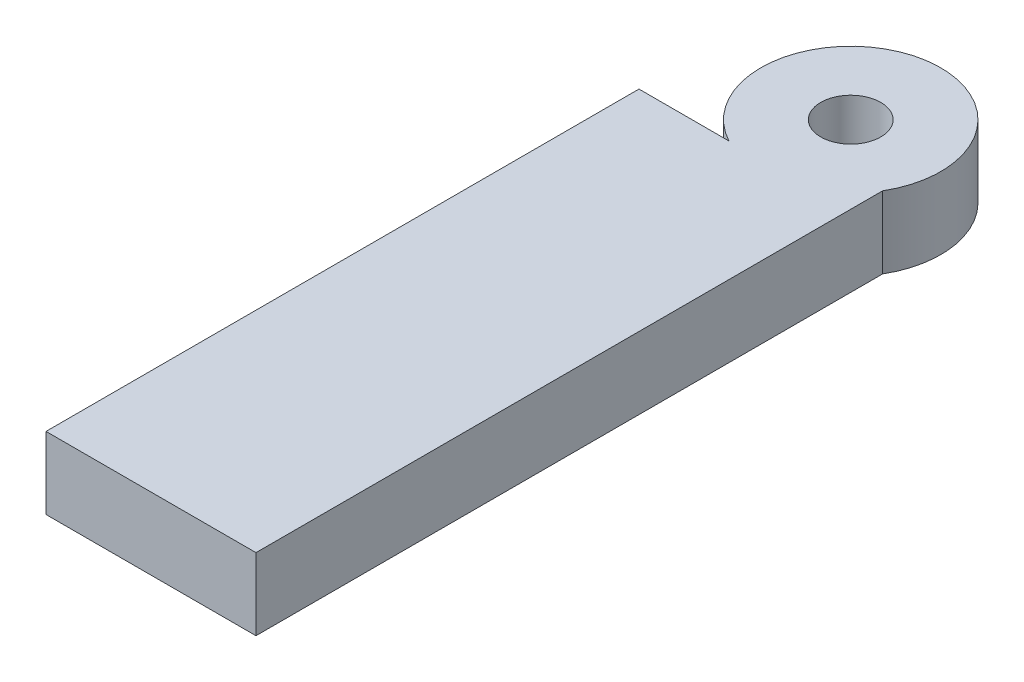
ISO-10303-21;
HEADER;
FILE_DESCRIPTION(('STEP AP214'),'2;1');
FILE_NAME('part.step','',(''),(''),'','','');
FILE_SCHEMA(('AUTOMOTIVE_DESIGN { 1 0 10303 214 1 1 1 1 }'));
ENDSEC;
DATA;
#1=APPLICATION_CONTEXT('core data for automotive mechanical design processes');
#2=APPLICATION_PROTOCOL_DEFINITION('international standard','automotive_design',2000,#1);
#3=PRODUCT_CONTEXT('',#1,'mechanical');
#4=PRODUCT('Part','Part','',(#3));
#5=PRODUCT_RELATED_PRODUCT_CATEGORY('part','',(#4));
#6=PRODUCT_DEFINITION_FORMATION('','',#4);
#7=PRODUCT_DEFINITION_CONTEXT('part definition',#1,'design');
#8=PRODUCT_DEFINITION('design','',#6,#7);
#9=PRODUCT_DEFINITION_SHAPE('','',#8);
#10=(LENGTH_UNIT() NAMED_UNIT(*) SI_UNIT(.MILLI.,.METRE.));
#11=(NAMED_UNIT(*) PLANE_ANGLE_UNIT() SI_UNIT($,.RADIAN.));
#12=(NAMED_UNIT(*) SI_UNIT($,.STERADIAN.) SOLID_ANGLE_UNIT());
#13=UNCERTAINTY_MEASURE_WITH_UNIT(LENGTH_MEASURE(1.E-05),#10,'distance_accuracy_value','');
#14=(GEOMETRIC_REPRESENTATION_CONTEXT(3) GLOBAL_UNCERTAINTY_ASSIGNED_CONTEXT((#13)) GLOBAL_UNIT_ASSIGNED_CONTEXT((#10,
#11,#12)) REPRESENTATION_CONTEXT('',''));
#15=CARTESIAN_POINT('',(0.,0.,0.));
#16=DIRECTION('',(0.,0.,1.));
#17=DIRECTION('',(1.,0.,0.));
#18=AXIS2_PLACEMENT_3D('',#15,#16,#17);
#19=CARTESIAN_POINT('',(8.20987193946542,7.62,0.));
#20=DIRECTION('',(-1.,0.,0.));
#21=DIRECTION('',(0.,0.,1.));
#22=AXIS2_PLACEMENT_3D('',#19,#20,#21);
#23=PLANE('',#22);
#24=DIRECTION('',(0.,0.,-1.));
#25=VECTOR('',#24,1.);
#26=CARTESIAN_POINT('',(8.20987193946542,0.,0.));
#27=LINE('',#26,#25);
#28=CARTESIAN_POINT('',(8.20987193946543,0.,71.1651280605346));
#29=VERTEX_POINT('',#28);
#30=CARTESIAN_POINT('',(8.20987193946542,0.,4.82945418630079));
#31=VERTEX_POINT('',#30);
#32=EDGE_CURVE('E125',#29,#31,#27,.T.);
#33=ORIENTED_EDGE('',*,*,#32,.T.);
#34=DIRECTION('',(0.,-1.,0.));
#35=VECTOR('',#34,1.);
#36=CARTESIAN_POINT('',(8.20987193946542,7.62,4.82945418630079));
#37=LINE('',#36,#35);
#38=CARTESIAN_POINT('',(8.20987193946542,7.62,4.82945418630079));
#39=VERTEX_POINT('',#38);
#40=EDGE_CURVE('E11',#39,#31,#37,.T.);
#41=ORIENTED_EDGE('',*,*,#40,.F.);
#42=DIRECTION('',(0.,0.,-1.));
#43=VECTOR('',#42,1.);
#44=CARTESIAN_POINT('',(8.20987193946542,7.62,0.));
#45=LINE('',#44,#43);
#46=CARTESIAN_POINT('',(8.20987193946543,7.62,71.1651280605346));
#47=VERTEX_POINT('',#46);
#48=EDGE_CURVE('E127',#47,#39,#45,.T.);
#49=ORIENTED_EDGE('',*,*,#48,.F.);
#50=DIRECTION('',(0.,-1.,0.));
#51=VECTOR('',#50,1.);
#52=CARTESIAN_POINT('',(8.20987193946543,7.62,71.1651280605346));
#53=LINE('',#52,#51);
#54=EDGE_CURVE('E135',#47,#29,#53,.T.);
#55=ORIENTED_EDGE('',*,*,#54,.T.);
#56=EDGE_LOOP('',(#33,#41,#49,#55));
#57=FACE_BOUND('',#56,.T.);
#58=ADVANCED_FACE('F41',(#57),#23,.F.);
#59=CARTESIAN_POINT('',(0.,7.62,0.));
#60=DIRECTION('',(0.,-1.,0.));
#61=DIRECTION('',(0.,0.,-1.));
#62=AXIS2_PLACEMENT_3D('',#59,#60,#61);
#63=CYLINDRICAL_SURFACE('',#62,9.525);
#64=CARTESIAN_POINT('',(0.,0.,0.));
#65=DIRECTION('',(0.,1.,0.));
#66=DIRECTION('',(0.,0.,1.));
#67=AXIS2_PLACEMENT_3D('',#64,#65,#66);
#68=CIRCLE('',#67,9.525);
#69=CARTESIAN_POINT('',(-4.49012806053458,0.,8.40026041263007));
#70=VERTEX_POINT('',#69);
#71=EDGE_CURVE('E71',#31,#70,#68,.T.);
#72=ORIENTED_EDGE('',*,*,#71,.T.);
#73=DIRECTION('',(0.,-1.,0.));
#74=VECTOR('',#73,1.);
#75=CARTESIAN_POINT('',(-4.49012806053458,7.62,8.40026041263007));
#76=LINE('',#75,#74);
#77=CARTESIAN_POINT('',(-4.49012806053458,7.62,8.40026041263007));
#78=VERTEX_POINT('',#77);
#79=EDGE_CURVE('E49',#78,#70,#76,.T.);
#80=ORIENTED_EDGE('',*,*,#79,.F.);
#81=CARTESIAN_POINT('',(0.,7.62,0.));
#82=DIRECTION('',(0.,1.,0.));
#83=DIRECTION('',(0.,0.,1.));
#84=AXIS2_PLACEMENT_3D('',#81,#82,#83);
#85=CIRCLE('',#84,9.525);
#86=EDGE_CURVE('E80',#39,#78,#85,.T.);
#87=ORIENTED_EDGE('',*,*,#86,.F.);
#88=ORIENTED_EDGE('',*,*,#40,.T.);
#89=EDGE_LOOP('',(#72,#80,#87,#88));
#90=FACE_BOUND('',#89,.T.);
#91=ADVANCED_FACE('F145',(#90),#63,.T.);
#92=CARTESIAN_POINT('',(0.,7.62,71.1651280605346));
#93=DIRECTION('',(0.,0.,-1.));
#94=DIRECTION('',(-1.,0.,0.));
#95=AXIS2_PLACEMENT_3D('',#92,#93,#94);
#96=PLANE('',#95);
#97=DIRECTION('',(1.,0.,0.));
#98=VECTOR('',#97,1.);
#99=CARTESIAN_POINT('',(0.,0.,71.1651280605346));
#100=LINE('',#99,#98);
#101=CARTESIAN_POINT('',(-14.0151280605346,0.,71.1651280605346));
#102=VERTEX_POINT('',#101);
#103=EDGE_CURVE('E77',#102,#29,#100,.T.);
#104=ORIENTED_EDGE('',*,*,#103,.T.);
#105=ORIENTED_EDGE('',*,*,#54,.F.);
#106=DIRECTION('',(1.,0.,0.));
#107=VECTOR('',#106,1.);
#108=CARTESIAN_POINT('',(0.,7.62,71.1651280605346));
#109=LINE('',#108,#107);
#110=CARTESIAN_POINT('',(-14.0151280605346,7.62,71.1651280605346));
#111=VERTEX_POINT('',#110);
#112=EDGE_CURVE('E57',#111,#47,#109,.T.);
#113=ORIENTED_EDGE('',*,*,#112,.F.);
#114=DIRECTION('',(0.,1.,0.));
#115=VECTOR('',#114,1.);
#116=CARTESIAN_POINT('',(-14.0151280605346,0.,71.1651280605346));
#117=LINE('',#116,#115);
#118=EDGE_CURVE('E102',#102,#111,#117,.T.);
#119=ORIENTED_EDGE('',*,*,#118,.F.);
#120=EDGE_LOOP('',(#104,#105,#113,#119));
#121=FACE_BOUND('',#120,.T.);
#122=ADVANCED_FACE('F147',(#121),#96,.F.);
#123=CARTESIAN_POINT('',(0.,7.62,0.));
#124=DIRECTION('',(0.,-1.,0.));
#125=DIRECTION('',(0.,0.,-1.));
#126=AXIS2_PLACEMENT_3D('',#123,#124,#125);
#127=CYLINDRICAL_SURFACE('',#126,3.175);
#128=CARTESIAN_POINT('',(0.,7.62,0.));
#129=DIRECTION('',(0.,1.,0.));
#130=DIRECTION('',(0.,0.,1.));
#131=AXIS2_PLACEMENT_3D('',#128,#129,#130);
#132=CIRCLE('',#131,3.175);
#133=CARTESIAN_POINT('',(0.,7.62,3.175));
#134=VERTEX_POINT('',#133);
#135=EDGE_CURVE('E132',#134,#134,#132,.T.);
#136=ORIENTED_EDGE('',*,*,#135,.T.);
#137=EDGE_LOOP('',(#136));
#138=FACE_BOUND('',#137,.T.);
#139=CARTESIAN_POINT('',(0.,0.,0.));
#140=DIRECTION('',(0.,1.,0.));
#141=DIRECTION('',(0.,0.,1.));
#142=AXIS2_PLACEMENT_3D('',#139,#140,#141);
#143=CIRCLE('',#142,3.175);
#144=CARTESIAN_POINT('',(0.,0.,3.175));
#145=VERTEX_POINT('',#144);
#146=EDGE_CURVE('E129',#145,#145,#143,.T.);
#147=ORIENTED_EDGE('',*,*,#146,.F.);
#148=EDGE_LOOP('',(#147));
#149=FACE_BOUND('',#148,.T.);
#150=ADVANCED_FACE('F152',(#138,#149),#127,.F.);
#151=CARTESIAN_POINT('',(0.,7.62,0.));
#152=DIRECTION('',(0.,1.,0.));
#153=DIRECTION('',(0.,0.,1.));
#154=AXIS2_PLACEMENT_3D('',#151,#152,#153);
#155=PLANE('',#154);
#156=ORIENTED_EDGE('',*,*,#48,.T.);
#157=ORIENTED_EDGE('',*,*,#86,.T.);
#158=DIRECTION('',(1.,0.,0.));
#159=VECTOR('',#158,1.);
#160=CARTESIAN_POINT('',(-14.0151280605346,7.62,8.40026041263007));
#161=LINE('',#160,#159);
#162=CARTESIAN_POINT('',(-14.0151280605346,7.62,8.40026041263007));
#163=VERTEX_POINT('',#162);
#164=EDGE_CURVE('E116',#163,#78,#161,.T.);
#165=ORIENTED_EDGE('',*,*,#164,.F.);
#166=DIRECTION('',(0.,0.,-1.));
#167=VECTOR('',#166,1.);
#168=CARTESIAN_POINT('',(-14.0151280605346,7.62,71.1651280605346));
#169=LINE('',#168,#167);
#170=EDGE_CURVE('E108',#111,#163,#169,.T.);
#171=ORIENTED_EDGE('',*,*,#170,.F.);
#172=ORIENTED_EDGE('',*,*,#112,.T.);
#173=EDGE_LOOP('',(#156,#157,#165,#171,#172));
#174=FACE_BOUND('',#173,.T.);
#175=ORIENTED_EDGE('',*,*,#135,.F.);
#176=EDGE_LOOP('',(#175));
#177=FACE_BOUND('',#176,.T.);
#178=ADVANCED_FACE('F157',(#174,#177),#155,.T.);
#179=CARTESIAN_POINT('',(0.,0.,0.));
#180=DIRECTION('',(0.,1.,0.));
#181=DIRECTION('',(0.,0.,1.));
#182=AXIS2_PLACEMENT_3D('',#179,#180,#181);
#183=PLANE('',#182);
#184=ORIENTED_EDGE('',*,*,#32,.F.);
#185=ORIENTED_EDGE('',*,*,#103,.F.);
#186=DIRECTION('',(0.,0.,1.));
#187=VECTOR('',#186,1.);
#188=CARTESIAN_POINT('',(-14.0151280605346,0.,8.40026041263007));
#189=LINE('',#188,#187);
#190=CARTESIAN_POINT('',(-14.0151280605346,0.,8.40026041263007));
#191=VERTEX_POINT('',#190);
#192=EDGE_CURVE('E92',#191,#102,#189,.T.);
#193=ORIENTED_EDGE('',*,*,#192,.F.);
#194=DIRECTION('',(1.,0.,0.));
#195=VECTOR('',#194,1.);
#196=CARTESIAN_POINT('',(-14.0151280605346,0.,8.40026041263007));
#197=LINE('',#196,#195);
#198=EDGE_CURVE('E98',#191,#70,#197,.T.);
#199=ORIENTED_EDGE('',*,*,#198,.T.);
#200=ORIENTED_EDGE('',*,*,#71,.F.);
#201=EDGE_LOOP('',(#184,#185,#193,#199,#200));
#202=FACE_BOUND('',#201,.T.);
#203=ORIENTED_EDGE('',*,*,#146,.T.);
#204=EDGE_LOOP('',(#203));
#205=FACE_BOUND('',#204,.T.);
#206=ADVANCED_FACE('F95',(#202,#205),#183,.F.);
#207=CARTESIAN_POINT('',(-14.0151280605346,0.,0.));
#208=DIRECTION('',(-1.,0.,0.));
#209=DIRECTION('',(0.,0.,1.));
#210=AXIS2_PLACEMENT_3D('',#207,#208,#209);
#211=PLANE('',#210);
#212=CARTESIAN_POINT('',(-14.0151280605346,3.81,52.8502604126301));
#213=DIRECTION('',(-1.,0.,0.));
#214=DIRECTION('',(0.,0.,1.));
#215=AXIS2_PLACEMENT_3D('',#212,#213,#214);
#216=CIRCLE('',#215,2.54);
#217=CARTESIAN_POINT('',(-14.0151280605346,3.81,55.3902604126301));
#218=VERTEX_POINT('',#217);
#219=EDGE_CURVE('E112',#218,#218,#216,.T.);
#220=ORIENTED_EDGE('',*,*,#219,.F.);
#221=EDGE_LOOP('',(#220));
#222=FACE_BOUND('',#221,.T.);
#223=DIRECTION('',(0.,-1.,0.));
#224=VECTOR('',#223,1.);
#225=CARTESIAN_POINT('',(-14.0151280605346,7.62,8.40026041263007));
#226=LINE('',#225,#224);
#227=EDGE_CURVE('E103',#163,#191,#226,.T.);
#228=ORIENTED_EDGE('',*,*,#227,.T.);
#229=ORIENTED_EDGE('',*,*,#192,.T.);
#230=ORIENTED_EDGE('',*,*,#118,.T.);
#231=ORIENTED_EDGE('',*,*,#170,.T.);
#232=EDGE_LOOP('',(#228,#229,#230,#231));
#233=FACE_BOUND('',#232,.T.);
#234=CARTESIAN_POINT('',(-14.0151280605346,3.81,14.7502604126301));
#235=DIRECTION('',(-1.,0.,0.));
#236=DIRECTION('',(0.,0.,1.));
#237=AXIS2_PLACEMENT_3D('',#234,#235,#236);
#238=CIRCLE('',#237,2.54);
#239=CARTESIAN_POINT('',(-14.0151280605346,3.81,17.2902604126301));
#240=VERTEX_POINT('',#239);
#241=EDGE_CURVE('E188',#240,#240,#238,.T.);
#242=ORIENTED_EDGE('',*,*,#241,.F.);
#243=EDGE_LOOP('',(#242));
#244=FACE_BOUND('',#243,.T.);
#245=ADVANCED_FACE('F106',(#222,#233,#244),#211,.T.);
#246=CARTESIAN_POINT('',(-14.0151280605346,7.62,8.40026041263007));
#247=DIRECTION('',(0.,0.,1.));
#248=DIRECTION('',(1.,0.,0.));
#249=AXIS2_PLACEMENT_3D('',#246,#247,#248);
#250=PLANE('',#249);
#251=ORIENTED_EDGE('',*,*,#79,.T.);
#252=ORIENTED_EDGE('',*,*,#198,.F.);
#253=ORIENTED_EDGE('',*,*,#227,.F.);
#254=ORIENTED_EDGE('',*,*,#164,.T.);
#255=EDGE_LOOP('',(#251,#252,#253,#254));
#256=FACE_BOUND('',#255,.T.);
#257=ADVANCED_FACE('F114',(#256),#250,.F.);
#258=CARTESIAN_POINT('',(1.85987193946542,3.81,52.8502604126301));
#259=DIRECTION('',(-1.,0.,0.));
#260=DIRECTION('',(0.,0.,1.));
#261=AXIS2_PLACEMENT_3D('',#258,#259,#260);
#262=PLANE('',#261);
#263=CARTESIAN_POINT('',(1.85987193946542,3.81,52.8502604126301));
#264=DIRECTION('',(-1.,0.,0.));
#265=DIRECTION('',(0.,0.,1.));
#266=AXIS2_PLACEMENT_3D('',#263,#264,#265);
#267=CIRCLE('',#266,2.54);
#268=CARTESIAN_POINT('',(1.85987193946542,3.81,55.3902604126301));
#269=VERTEX_POINT('',#268);
#270=EDGE_CURVE('E115',#269,#269,#267,.T.);
#271=ORIENTED_EDGE('',*,*,#270,.T.);
#272=EDGE_LOOP('',(#271));
#273=FACE_BOUND('',#272,.T.);
#274=ADVANCED_FACE('F163',(#273),#262,.T.);
#275=CARTESIAN_POINT('',(1.85987193946542,3.81,52.8502604126301));
#276=DIRECTION('',(-1.,0.,0.));
#277=DIRECTION('',(0.,0.,1.));
#278=AXIS2_PLACEMENT_3D('',#275,#276,#277);
#279=CYLINDRICAL_SURFACE('',#278,2.54);
#280=ORIENTED_EDGE('',*,*,#270,.F.);
#281=EDGE_LOOP('',(#280));
#282=FACE_BOUND('',#281,.T.);
#283=ORIENTED_EDGE('',*,*,#219,.T.);
#284=EDGE_LOOP('',(#283));
#285=FACE_BOUND('',#284,.T.);
#286=ADVANCED_FACE('F166',(#282,#285),#279,.F.);
#287=CARTESIAN_POINT('',(1.85987193946542,3.81,14.7502604126301));
#288=DIRECTION('',(-1.,0.,0.));
#289=DIRECTION('',(0.,0.,1.));
#290=AXIS2_PLACEMENT_3D('',#287,#288,#289);
#291=PLANE('',#290);
#292=CARTESIAN_POINT('',(1.85987193946542,3.81,14.7502604126301));
#293=DIRECTION('',(-1.,0.,0.));
#294=DIRECTION('',(0.,0.,1.));
#295=AXIS2_PLACEMENT_3D('',#292,#293,#294);
#296=CIRCLE('',#295,2.54);
#297=CARTESIAN_POINT('',(1.85987193946542,3.81,17.2902604126301));
#298=VERTEX_POINT('',#297);
#299=EDGE_CURVE('E119',#298,#298,#296,.T.);
#300=ORIENTED_EDGE('',*,*,#299,.T.);
#301=EDGE_LOOP('',(#300));
#302=FACE_BOUND('',#301,.T.);
#303=ADVANCED_FACE('F170',(#302),#291,.T.);
#304=CARTESIAN_POINT('',(1.85987193946542,3.81,14.7502604126301));
#305=DIRECTION('',(-1.,0.,0.));
#306=DIRECTION('',(0.,0.,1.));
#307=AXIS2_PLACEMENT_3D('',#304,#305,#306);
#308=CYLINDRICAL_SURFACE('',#307,2.54);
#309=ORIENTED_EDGE('',*,*,#299,.F.);
#310=EDGE_LOOP('',(#309));
#311=FACE_BOUND('',#310,.T.);
#312=ORIENTED_EDGE('',*,*,#241,.T.);
#313=EDGE_LOOP('',(#312));
#314=FACE_BOUND('',#313,.T.);
#315=ADVANCED_FACE('F172',(#311,#314),#308,.F.);
#316=CLOSED_SHELL('',(#58,#91,#122,#150,#178,#206,#245,#257,#274,#286,#303,#315));
#317=MANIFOLD_SOLID_BREP('B2',#316);
#318=ADVANCED_BREP_SHAPE_REPRESENTATION('',(#18,#317),#14);
#319=SHAPE_DEFINITION_REPRESENTATION(#9,#318);
ENDSEC;
END-ISO-10303-21;
